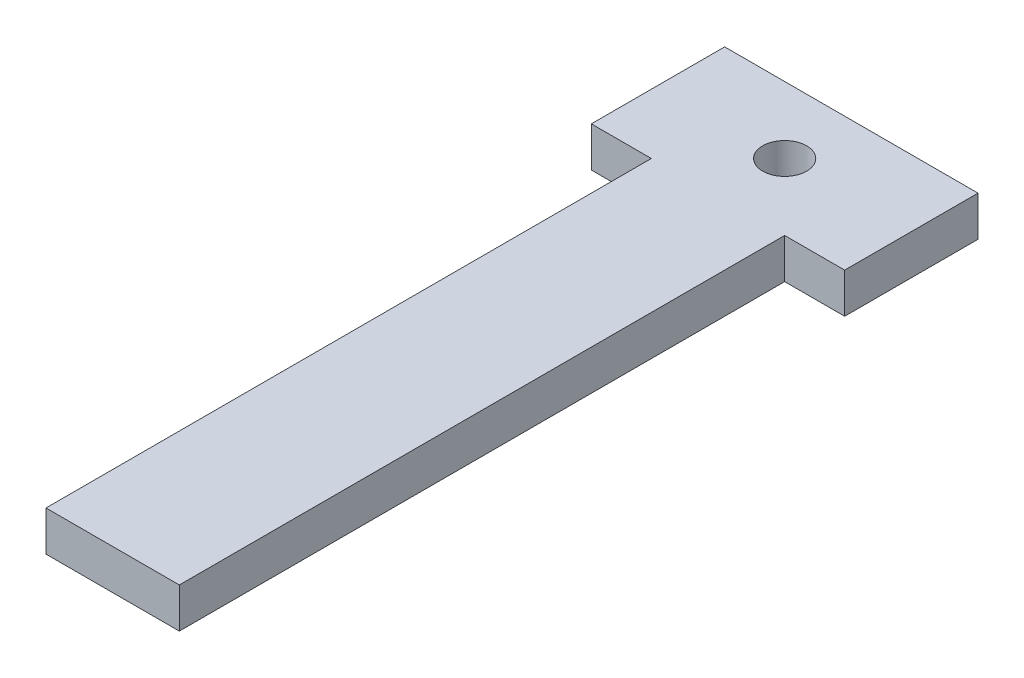
ISO-10303-21;
HEADER;
FILE_DESCRIPTION(('STEP AP214'),'2;1');
FILE_NAME('part.step','',(''),(''),'','','');
FILE_SCHEMA(('AUTOMOTIVE_DESIGN { 1 0 10303 214 1 1 1 1 }'));
ENDSEC;
DATA;
#1=APPLICATION_CONTEXT('core data for automotive mechanical design processes');
#2=APPLICATION_PROTOCOL_DEFINITION('international standard','automotive_design',2000,#1);
#3=PRODUCT_CONTEXT('',#1,'mechanical');
#4=PRODUCT('Part','Part','',(#3));
#5=PRODUCT_RELATED_PRODUCT_CATEGORY('part','',(#4));
#6=PRODUCT_DEFINITION_FORMATION('','',#4);
#7=PRODUCT_DEFINITION_CONTEXT('part definition',#1,'design');
#8=PRODUCT_DEFINITION('design','',#6,#7);
#9=PRODUCT_DEFINITION_SHAPE('','',#8);
#10=(LENGTH_UNIT() NAMED_UNIT(*) SI_UNIT(.MILLI.,.METRE.));
#11=(NAMED_UNIT(*) PLANE_ANGLE_UNIT() SI_UNIT($,.RADIAN.));
#12=(NAMED_UNIT(*) SI_UNIT($,.STERADIAN.) SOLID_ANGLE_UNIT());
#13=UNCERTAINTY_MEASURE_WITH_UNIT(LENGTH_MEASURE(1.E-05),#10,'distance_accuracy_value','');
#14=(GEOMETRIC_REPRESENTATION_CONTEXT(3) GLOBAL_UNCERTAINTY_ASSIGNED_CONTEXT((#13)) GLOBAL_UNIT_ASSIGNED_CONTEXT((#10,
#11,#12)) REPRESENTATION_CONTEXT('',''));
#15=CARTESIAN_POINT('',(0.,0.,0.));
#16=DIRECTION('',(0.,0.,1.));
#17=DIRECTION('',(1.,0.,0.));
#18=AXIS2_PLACEMENT_3D('',#15,#16,#17);
#19=CARTESIAN_POINT('',(0.,3.,-5.));
#20=DIRECTION('',(0.,0.,1.));
#21=DIRECTION('',(1.,0.,0.));
#22=AXIS2_PLACEMENT_3D('',#19,#20,#21);
#23=PLANE('',#22);
#24=DIRECTION('',(-1.,0.,0.));
#25=VECTOR('',#24,1.);
#26=CARTESIAN_POINT('',(0.,0.,-5.));
#27=LINE('',#26,#25);
#28=CARTESIAN_POINT('',(9.50000000000001,0.,-5.));
#29=VERTEX_POINT('',#28);
#30=CARTESIAN_POINT('',(-9.50000000000001,0.,-5.));
#31=VERTEX_POINT('',#30);
#32=EDGE_CURVE('E141',#29,#31,#27,.T.);
#33=ORIENTED_EDGE('',*,*,#32,.T.);
#34=DIRECTION('',(0.,-1.,0.));
#35=VECTOR('',#34,1.);
#36=CARTESIAN_POINT('',(-9.50000000000001,3.,-5.));
#37=LINE('',#36,#35);
#38=CARTESIAN_POINT('',(-9.50000000000001,3.,-5.));
#39=VERTEX_POINT('',#38);
#40=EDGE_CURVE('E11',#39,#31,#37,.T.);
#41=ORIENTED_EDGE('',*,*,#40,.F.);
#42=DIRECTION('',(-1.,0.,0.));
#43=VECTOR('',#42,1.);
#44=CARTESIAN_POINT('',(0.,3.,-5.));
#45=LINE('',#44,#43);
#46=CARTESIAN_POINT('',(9.50000000000001,3.,-5.));
#47=VERTEX_POINT('',#46);
#48=EDGE_CURVE('E96',#47,#39,#45,.T.);
#49=ORIENTED_EDGE('',*,*,#48,.F.);
#50=DIRECTION('',(0.,-1.,0.));
#51=VECTOR('',#50,1.);
#52=CARTESIAN_POINT('',(9.50000000000001,3.,-5.));
#53=LINE('',#52,#51);
#54=EDGE_CURVE('E134',#47,#29,#53,.T.);
#55=ORIENTED_EDGE('',*,*,#54,.T.);
#56=EDGE_LOOP('',(#33,#41,#49,#55));
#57=FACE_BOUND('',#56,.T.);
#58=ADVANCED_FACE('F43',(#57),#23,.F.);
#59=CARTESIAN_POINT('',(-9.50000000000001,3.,0.));
#60=DIRECTION('',(-1.,0.,0.));
#61=DIRECTION('',(0.,0.,1.));
#62=AXIS2_PLACEMENT_3D('',#59,#60,#61);
#63=PLANE('',#62);
#64=DIRECTION('',(0.,0.,-1.));
#65=VECTOR('',#64,1.);
#66=CARTESIAN_POINT('',(-9.50000000000001,0.,0.));
#67=LINE('',#66,#65);
#68=CARTESIAN_POINT('',(-9.50000000000001,0.,5.));
#69=VERTEX_POINT('',#68);
#70=EDGE_CURVE('E144',#69,#31,#67,.T.);
#71=ORIENTED_EDGE('',*,*,#70,.F.);
#72=DIRECTION('',(0.,-1.,0.));
#73=VECTOR('',#72,1.);
#74=CARTESIAN_POINT('',(-9.50000000000001,3.,5.));
#75=LINE('',#74,#73);
#76=CARTESIAN_POINT('',(-9.50000000000001,3.,5.));
#77=VERTEX_POINT('',#76);
#78=EDGE_CURVE('E52',#77,#69,#75,.T.);
#79=ORIENTED_EDGE('',*,*,#78,.F.);
#80=DIRECTION('',(0.,0.,-1.));
#81=VECTOR('',#80,1.);
#82=CARTESIAN_POINT('',(-9.50000000000001,3.,0.));
#83=LINE('',#82,#81);
#84=EDGE_CURVE('E181',#77,#39,#83,.T.);
#85=ORIENTED_EDGE('',*,*,#84,.T.);
#86=ORIENTED_EDGE('',*,*,#40,.T.);
#87=EDGE_LOOP('',(#71,#79,#85,#86));
#88=FACE_BOUND('',#87,.T.);
#89=ADVANCED_FACE('F180',(#88),#63,.T.);
#90=CARTESIAN_POINT('',(0.,3.,5.));
#91=DIRECTION('',(0.,0.,-1.));
#92=DIRECTION('',(-1.,0.,0.));
#93=AXIS2_PLACEMENT_3D('',#90,#91,#92);
#94=PLANE('',#93);
#95=DIRECTION('',(1.,0.,0.));
#96=VECTOR('',#95,1.);
#97=CARTESIAN_POINT('',(0.,0.,5.));
#98=LINE('',#97,#96);
#99=CARTESIAN_POINT('',(-5.00000000000001,0.,5.));
#100=VERTEX_POINT('',#99);
#101=EDGE_CURVE('E147',#69,#100,#98,.T.);
#102=ORIENTED_EDGE('',*,*,#101,.T.);
#103=DIRECTION('',(0.,-1.,0.));
#104=VECTOR('',#103,1.);
#105=CARTESIAN_POINT('',(-5.00000000000001,3.,5.));
#106=LINE('',#105,#104);
#107=CARTESIAN_POINT('',(-5.00000000000001,3.,5.));
#108=VERTEX_POINT('',#107);
#109=EDGE_CURVE('E164',#108,#100,#106,.T.);
#110=ORIENTED_EDGE('',*,*,#109,.F.);
#111=DIRECTION('',(1.,0.,0.));
#112=VECTOR('',#111,1.);
#113=CARTESIAN_POINT('',(0.,3.,5.));
#114=LINE('',#113,#112);
#115=EDGE_CURVE('E171',#77,#108,#114,.T.);
#116=ORIENTED_EDGE('',*,*,#115,.F.);
#117=ORIENTED_EDGE('',*,*,#78,.T.);
#118=EDGE_LOOP('',(#102,#110,#116,#117));
#119=FACE_BOUND('',#118,.T.);
#120=ADVANCED_FACE('F169',(#119),#94,.F.);
#121=CARTESIAN_POINT('',(-5.00000000000001,3.,0.));
#122=DIRECTION('',(1.,0.,0.));
#123=DIRECTION('',(0.,0.,-1.));
#124=AXIS2_PLACEMENT_3D('',#121,#122,#123);
#125=PLANE('',#124);
#126=DIRECTION('',(0.,0.,1.));
#127=VECTOR('',#126,1.);
#128=CARTESIAN_POINT('',(-5.00000000000001,0.,0.));
#129=LINE('',#128,#127);
#130=CARTESIAN_POINT('',(-5.,0.,50.4));
#131=VERTEX_POINT('',#130);
#132=EDGE_CURVE('E149',#100,#131,#129,.T.);
#133=ORIENTED_EDGE('',*,*,#132,.T.);
#134=DIRECTION('',(0.,-1.,0.));
#135=VECTOR('',#134,1.);
#136=CARTESIAN_POINT('',(-5.,3.,50.4));
#137=LINE('',#136,#135);
#138=CARTESIAN_POINT('',(-5.,3.,50.4));
#139=VERTEX_POINT('',#138);
#140=EDGE_CURVE('E161',#139,#131,#137,.T.);
#141=ORIENTED_EDGE('',*,*,#140,.F.);
#142=DIRECTION('',(0.,0.,1.));
#143=VECTOR('',#142,1.);
#144=CARTESIAN_POINT('',(-5.00000000000001,3.,0.));
#145=LINE('',#144,#143);
#146=EDGE_CURVE('E189',#108,#139,#145,.T.);
#147=ORIENTED_EDGE('',*,*,#146,.F.);
#148=ORIENTED_EDGE('',*,*,#109,.T.);
#149=EDGE_LOOP('',(#133,#141,#147,#148));
#150=FACE_BOUND('',#149,.T.);
#151=ADVANCED_FACE('F188',(#150),#125,.F.);
#152=CARTESIAN_POINT('',(0.,3.,50.4));
#153=DIRECTION('',(0.,0.,-1.));
#154=DIRECTION('',(-1.,0.,0.));
#155=AXIS2_PLACEMENT_3D('',#152,#153,#154);
#156=PLANE('',#155);
#157=DIRECTION('',(1.,0.,0.));
#158=VECTOR('',#157,1.);
#159=CARTESIAN_POINT('',(0.,0.,50.4));
#160=LINE('',#159,#158);
#161=CARTESIAN_POINT('',(5.,0.,50.4));
#162=VERTEX_POINT('',#161);
#163=EDGE_CURVE('E151',#131,#162,#160,.T.);
#164=ORIENTED_EDGE('',*,*,#163,.T.);
#165=DIRECTION('',(0.,-1.,0.));
#166=VECTOR('',#165,1.);
#167=CARTESIAN_POINT('',(5.,3.,50.4));
#168=LINE('',#167,#166);
#169=CARTESIAN_POINT('',(5.,3.,50.4));
#170=VERTEX_POINT('',#169);
#171=EDGE_CURVE('E130',#170,#162,#168,.T.);
#172=ORIENTED_EDGE('',*,*,#171,.F.);
#173=DIRECTION('',(1.,0.,0.));
#174=VECTOR('',#173,1.);
#175=CARTESIAN_POINT('',(0.,3.,50.4));
#176=LINE('',#175,#174);
#177=EDGE_CURVE('E117',#139,#170,#176,.T.);
#178=ORIENTED_EDGE('',*,*,#177,.F.);
#179=ORIENTED_EDGE('',*,*,#140,.T.);
#180=EDGE_LOOP('',(#164,#172,#178,#179));
#181=FACE_BOUND('',#180,.T.);
#182=ADVANCED_FACE('F184',(#181),#156,.F.);
#183=CARTESIAN_POINT('',(5.00000000000001,3.,0.));
#184=DIRECTION('',(-1.,0.,0.));
#185=DIRECTION('',(0.,0.,1.));
#186=AXIS2_PLACEMENT_3D('',#183,#184,#185);
#187=PLANE('',#186);
#188=DIRECTION('',(0.,0.,-1.));
#189=VECTOR('',#188,1.);
#190=CARTESIAN_POINT('',(5.00000000000001,0.,0.));
#191=LINE('',#190,#189);
#192=CARTESIAN_POINT('',(5.00000000000001,0.,5.));
#193=VERTEX_POINT('',#192);
#194=EDGE_CURVE('E126',#162,#193,#191,.T.);
#195=ORIENTED_EDGE('',*,*,#194,.T.);
#196=DIRECTION('',(0.,-1.,0.));
#197=VECTOR('',#196,1.);
#198=CARTESIAN_POINT('',(5.00000000000001,3.,5.));
#199=LINE('',#198,#197);
#200=CARTESIAN_POINT('',(5.00000000000001,3.,5.));
#201=VERTEX_POINT('',#200);
#202=EDGE_CURVE('E123',#201,#193,#199,.T.);
#203=ORIENTED_EDGE('',*,*,#202,.F.);
#204=DIRECTION('',(0.,0.,-1.));
#205=VECTOR('',#204,1.);
#206=CARTESIAN_POINT('',(5.00000000000001,3.,0.));
#207=LINE('',#206,#205);
#208=EDGE_CURVE('E111',#170,#201,#207,.T.);
#209=ORIENTED_EDGE('',*,*,#208,.F.);
#210=ORIENTED_EDGE('',*,*,#171,.T.);
#211=EDGE_LOOP('',(#195,#203,#209,#210));
#212=FACE_BOUND('',#211,.T.);
#213=ADVANCED_FACE('F124',(#212),#187,.F.);
#214=CARTESIAN_POINT('',(0.,3.,4.99999999999999));
#215=DIRECTION('',(0.,0.,1.));
#216=DIRECTION('',(1.,0.,0.));
#217=AXIS2_PLACEMENT_3D('',#214,#215,#216);
#218=PLANE('',#217);
#219=DIRECTION('',(-1.,0.,0.));
#220=VECTOR('',#219,1.);
#221=CARTESIAN_POINT('',(0.,0.,4.99999999999999));
#222=LINE('',#221,#220);
#223=CARTESIAN_POINT('',(9.50000000000001,0.,5.));
#224=VERTEX_POINT('',#223);
#225=EDGE_CURVE('E154',#224,#193,#222,.T.);
#226=ORIENTED_EDGE('',*,*,#225,.F.);
#227=DIRECTION('',(0.,-1.,0.));
#228=VECTOR('',#227,1.);
#229=CARTESIAN_POINT('',(9.50000000000001,3.,5.));
#230=LINE('',#229,#228);
#231=CARTESIAN_POINT('',(9.50000000000001,3.,5.));
#232=VERTEX_POINT('',#231);
#233=EDGE_CURVE('E87',#232,#224,#230,.T.);
#234=ORIENTED_EDGE('',*,*,#233,.F.);
#235=DIRECTION('',(-1.,0.,0.));
#236=VECTOR('',#235,1.);
#237=CARTESIAN_POINT('',(0.,3.,4.99999999999999));
#238=LINE('',#237,#236);
#239=EDGE_CURVE('E115',#232,#201,#238,.T.);
#240=ORIENTED_EDGE('',*,*,#239,.T.);
#241=ORIENTED_EDGE('',*,*,#202,.T.);
#242=EDGE_LOOP('',(#226,#234,#240,#241));
#243=FACE_BOUND('',#242,.T.);
#244=ADVANCED_FACE('F132',(#243),#218,.T.);
#245=CARTESIAN_POINT('',(0.,3.,0.));
#246=DIRECTION('',(0.,-1.,0.));
#247=DIRECTION('',(0.,0.,-1.));
#248=AXIS2_PLACEMENT_3D('',#245,#246,#247);
#249=CYLINDRICAL_SURFACE('',#248,1.65);
#250=CARTESIAN_POINT('',(0.,3.,0.));
#251=DIRECTION('',(0.,1.,0.));
#252=DIRECTION('',(0.,0.,1.));
#253=AXIS2_PLACEMENT_3D('',#250,#251,#252);
#254=CIRCLE('',#253,1.65);
#255=CARTESIAN_POINT('',(0.,3.,1.65));
#256=VERTEX_POINT('',#255);
#257=EDGE_CURVE('E157',#256,#256,#254,.T.);
#258=ORIENTED_EDGE('',*,*,#257,.T.);
#259=EDGE_LOOP('',(#258));
#260=FACE_BOUND('',#259,.T.);
#261=CARTESIAN_POINT('',(0.,0.,0.));
#262=DIRECTION('',(0.,1.,0.));
#263=DIRECTION('',(0.,0.,1.));
#264=AXIS2_PLACEMENT_3D('',#261,#262,#263);
#265=CIRCLE('',#264,1.65);
#266=CARTESIAN_POINT('',(0.,0.,1.65));
#267=VERTEX_POINT('',#266);
#268=EDGE_CURVE('E138',#267,#267,#265,.T.);
#269=ORIENTED_EDGE('',*,*,#268,.F.);
#270=EDGE_LOOP('',(#269));
#271=FACE_BOUND('',#270,.T.);
#272=ADVANCED_FACE('F45',(#260,#271),#249,.F.);
#273=CARTESIAN_POINT('',(9.50000000000001,3.,0.));
#274=DIRECTION('',(-1.,0.,0.));
#275=DIRECTION('',(0.,0.,1.));
#276=AXIS2_PLACEMENT_3D('',#273,#274,#275);
#277=PLANE('',#276);
#278=DIRECTION('',(0.,0.,-1.));
#279=VECTOR('',#278,1.);
#280=CARTESIAN_POINT('',(9.50000000000001,0.,0.));
#281=LINE('',#280,#279);
#282=EDGE_CURVE('E90',#224,#29,#281,.T.);
#283=ORIENTED_EDGE('',*,*,#282,.T.);
#284=ORIENTED_EDGE('',*,*,#54,.F.);
#285=DIRECTION('',(0.,0.,-1.));
#286=VECTOR('',#285,1.);
#287=CARTESIAN_POINT('',(9.50000000000001,3.,0.));
#288=LINE('',#287,#286);
#289=EDGE_CURVE('E60',#232,#47,#288,.T.);
#290=ORIENTED_EDGE('',*,*,#289,.F.);
#291=ORIENTED_EDGE('',*,*,#233,.T.);
#292=EDGE_LOOP('',(#283,#284,#290,#291));
#293=FACE_BOUND('',#292,.T.);
#294=ADVANCED_FACE('F201',(#293),#277,.F.);
#295=CARTESIAN_POINT('',(0.,3.,0.));
#296=DIRECTION('',(0.,1.,0.));
#297=DIRECTION('',(0.,0.,1.));
#298=AXIS2_PLACEMENT_3D('',#295,#296,#297);
#299=PLANE('',#298);
#300=ORIENTED_EDGE('',*,*,#257,.F.);
#301=EDGE_LOOP('',(#300));
#302=FACE_BOUND('',#301,.T.);
#303=ORIENTED_EDGE('',*,*,#48,.T.);
#304=ORIENTED_EDGE('',*,*,#84,.F.);
#305=ORIENTED_EDGE('',*,*,#115,.T.);
#306=ORIENTED_EDGE('',*,*,#146,.T.);
#307=ORIENTED_EDGE('',*,*,#177,.T.);
#308=ORIENTED_EDGE('',*,*,#208,.T.);
#309=ORIENTED_EDGE('',*,*,#239,.F.);
#310=ORIENTED_EDGE('',*,*,#289,.T.);
#311=EDGE_LOOP('',(#303,#304,#305,#306,#307,#308,#309,#310));
#312=FACE_BOUND('',#311,.T.);
#313=ADVANCED_FACE('F113',(#302,#312),#299,.T.);
#314=CARTESIAN_POINT('',(0.,0.,0.));
#315=DIRECTION('',(0.,1.,0.));
#316=DIRECTION('',(0.,0.,1.));
#317=AXIS2_PLACEMENT_3D('',#314,#315,#316);
#318=PLANE('',#317);
#319=ORIENTED_EDGE('',*,*,#268,.T.);
#320=EDGE_LOOP('',(#319));
#321=FACE_BOUND('',#320,.T.);
#322=ORIENTED_EDGE('',*,*,#32,.F.);
#323=ORIENTED_EDGE('',*,*,#282,.F.);
#324=ORIENTED_EDGE('',*,*,#225,.T.);
#325=ORIENTED_EDGE('',*,*,#194,.F.);
#326=ORIENTED_EDGE('',*,*,#163,.F.);
#327=ORIENTED_EDGE('',*,*,#132,.F.);
#328=ORIENTED_EDGE('',*,*,#101,.F.);
#329=ORIENTED_EDGE('',*,*,#70,.T.);
#330=EDGE_LOOP('',(#322,#323,#324,#325,#326,#327,#328,#329));
#331=FACE_BOUND('',#330,.T.);
#332=ADVANCED_FACE('F178',(#321,#331),#318,.F.);
#333=CLOSED_SHELL('',(#58,#89,#120,#151,#182,#213,#244,#272,#294,#313,#332));
#334=MANIFOLD_SOLID_BREP('B2',#333);
#335=ADVANCED_BREP_SHAPE_REPRESENTATION('',(#18,#334),#14);
#336=SHAPE_DEFINITION_REPRESENTATION(#9,#335);
ENDSEC;
END-ISO-10303-21;
